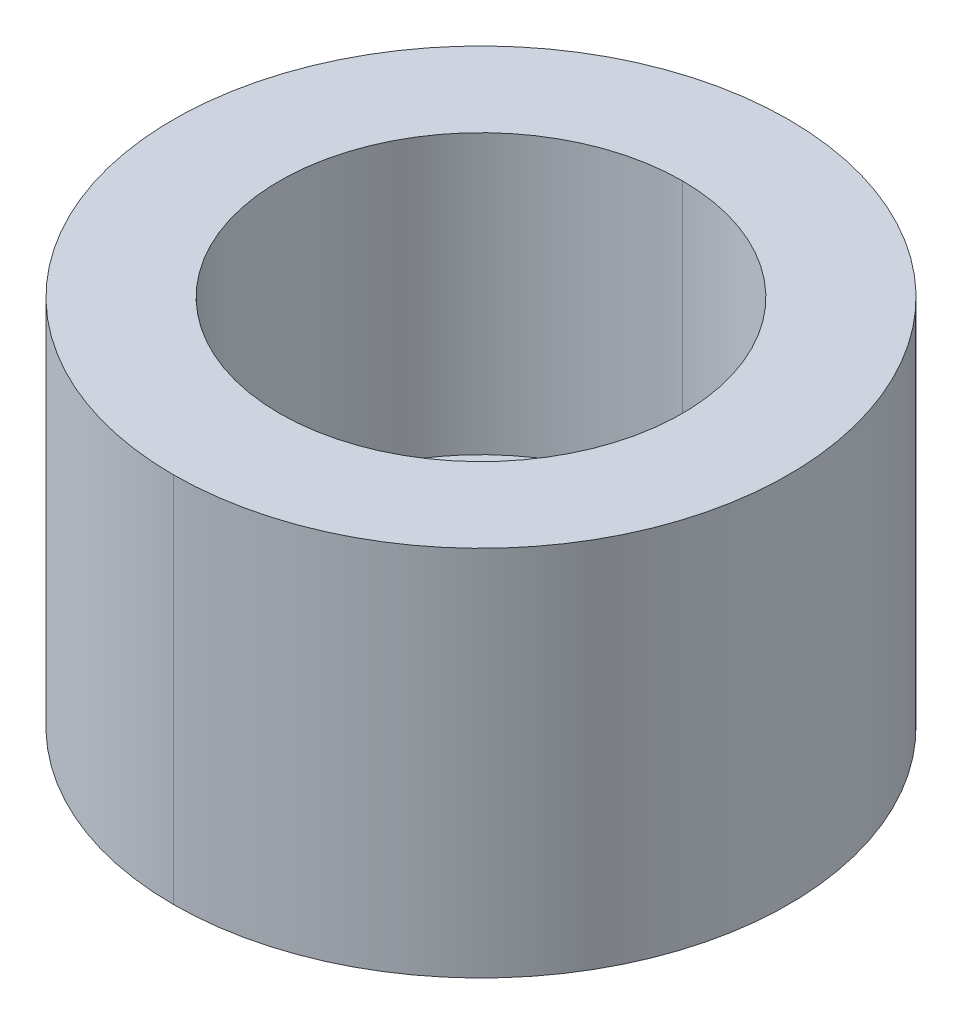
ISO-10303-21;
HEADER;
FILE_DESCRIPTION(('STEP AP214'),'2;1');
FILE_NAME('part.step','',(''),(''),'','','');
FILE_SCHEMA(('AUTOMOTIVE_DESIGN { 1 0 10303 214 1 1 1 1 }'));
ENDSEC;
DATA;
#1=APPLICATION_CONTEXT('core data for automotive mechanical design processes');
#2=APPLICATION_PROTOCOL_DEFINITION('international standard','automotive_design',2000,#1);
#3=PRODUCT_CONTEXT('',#1,'mechanical');
#4=PRODUCT('Part','Part','',(#3));
#5=PRODUCT_RELATED_PRODUCT_CATEGORY('part','',(#4));
#6=PRODUCT_DEFINITION_FORMATION('','',#4);
#7=PRODUCT_DEFINITION_CONTEXT('part definition',#1,'design');
#8=PRODUCT_DEFINITION('design','',#6,#7);
#9=PRODUCT_DEFINITION_SHAPE('','',#8);
#10=(LENGTH_UNIT() NAMED_UNIT(*) SI_UNIT(.MILLI.,.METRE.));
#11=(NAMED_UNIT(*) PLANE_ANGLE_UNIT() SI_UNIT($,.RADIAN.));
#12=(NAMED_UNIT(*) SI_UNIT($,.STERADIAN.) SOLID_ANGLE_UNIT());
#13=UNCERTAINTY_MEASURE_WITH_UNIT(LENGTH_MEASURE(1.E-05),#10,'distance_accuracy_value','');
#14=(GEOMETRIC_REPRESENTATION_CONTEXT(3) GLOBAL_UNCERTAINTY_ASSIGNED_CONTEXT((#13)) GLOBAL_UNIT_ASSIGNED_CONTEXT((#10,
#11,#12)) REPRESENTATION_CONTEXT('',''));
#15=CARTESIAN_POINT('',(0.,0.,0.));
#16=DIRECTION('',(0.,0.,1.));
#17=DIRECTION('',(1.,0.,0.));
#18=AXIS2_PLACEMENT_3D('',#15,#16,#17);
#19=CARTESIAN_POINT('',(0.,2.3876,0.));
#20=DIRECTION('',(0.,1.,0.));
#21=DIRECTION('',(0.,0.,1.));
#22=AXIS2_PLACEMENT_3D('',#19,#20,#21);
#23=PLANE('',#22);
#24=CARTESIAN_POINT('',(0.,2.3876,0.));
#25=DIRECTION('',(0.,-1.,0.));
#26=DIRECTION('',(0.,0.,-1.));
#27=AXIS2_PLACEMENT_3D('',#24,#25,#26);
#28=CIRCLE('',#27,3.5687);
#29=CARTESIAN_POINT('',(0.,2.3876,3.5687));
#30=VERTEX_POINT('',#29);
#31=CARTESIAN_POINT('',(0.,2.3876,-3.5687));
#32=VERTEX_POINT('',#31);
#33=EDGE_CURVE('E82',#30,#32,#28,.T.);
#34=ORIENTED_EDGE('',*,*,#33,.T.);
#35=CARTESIAN_POINT('',(0.,2.3876,0.));
#36=DIRECTION('',(0.,-1.,0.));
#37=DIRECTION('',(0.,0.,-1.));
#38=AXIS2_PLACEMENT_3D('',#35,#36,#37);
#39=CIRCLE('',#38,3.5687);
#40=EDGE_CURVE('E78',#32,#30,#39,.T.);
#41=ORIENTED_EDGE('',*,*,#40,.T.);
#42=EDGE_LOOP('',(#34,#41));
#43=FACE_BOUND('',#42,.T.);
#44=CARTESIAN_POINT('',(0.,2.3876,0.));
#45=DIRECTION('',(0.,1.,0.));
#46=DIRECTION('',(0.,0.,1.));
#47=AXIS2_PLACEMENT_3D('',#44,#45,#46);
#48=CIRCLE('',#47,5.1562);
#49=CARTESIAN_POINT('',(0.,2.3876,5.1562));
#50=VERTEX_POINT('',#49);
#51=CARTESIAN_POINT('',(0.,2.3876,-5.1562));
#52=VERTEX_POINT('',#51);
#53=EDGE_CURVE('E62',#50,#52,#48,.T.);
#54=ORIENTED_EDGE('',*,*,#53,.T.);
#55=CARTESIAN_POINT('',(0.,2.3876,0.));
#56=DIRECTION('',(0.,1.,0.));
#57=DIRECTION('',(0.,0.,1.));
#58=AXIS2_PLACEMENT_3D('',#55,#56,#57);
#59=CIRCLE('',#58,5.1562);
#60=EDGE_CURVE('E18',#52,#50,#59,.T.);
#61=ORIENTED_EDGE('',*,*,#60,.T.);
#62=EDGE_LOOP('',(#54,#61));
#63=FACE_BOUND('',#62,.T.);
#64=ADVANCED_FACE('F15',(#43,#63),#23,.T.);
#65=CARTESIAN_POINT('',(0.,9.525,0.));
#66=DIRECTION('',(0.,1.,0.));
#67=DIRECTION('',(0.,0.,1.));
#68=AXIS2_PLACEMENT_3D('',#65,#66,#67);
#69=CYLINDRICAL_SURFACE('',#68,5.1562);
#70=ORIENTED_EDGE('',*,*,#60,.F.);
#71=DIRECTION('',(0.,1.,0.));
#72=VECTOR('',#71,1.);
#73=CARTESIAN_POINT('',(0.,9.525,-5.1562));
#74=LINE('',#73,#72);
#75=CARTESIAN_POINT('',(0.,9.525,-5.1562));
#76=VERTEX_POINT('',#75);
#77=EDGE_CURVE('E77',#52,#76,#74,.T.);
#78=ORIENTED_EDGE('',*,*,#77,.T.);
#79=CARTESIAN_POINT('',(0.,9.525,0.));
#80=DIRECTION('',(0.,1.,0.));
#81=DIRECTION('',(0.,0.,1.));
#82=AXIS2_PLACEMENT_3D('',#79,#80,#81);
#83=CIRCLE('',#82,5.1562);
#84=CARTESIAN_POINT('',(0.,9.525,5.1562));
#85=VERTEX_POINT('',#84);
#86=EDGE_CURVE('E71',#76,#85,#83,.T.);
#87=ORIENTED_EDGE('',*,*,#86,.T.);
#88=DIRECTION('',(0.,1.,0.));
#89=VECTOR('',#88,1.);
#90=CARTESIAN_POINT('',(0.,9.525,5.1562));
#91=LINE('',#90,#89);
#92=EDGE_CURVE('E67',#85,#50,#91,.F.);
#93=ORIENTED_EDGE('',*,*,#92,.T.);
#94=EDGE_LOOP('',(#70,#78,#87,#93));
#95=FACE_BOUND('',#94,.T.);
#96=ADVANCED_FACE('F69',(#95),#69,.F.);
#97=CARTESIAN_POINT('',(0.,9.525,0.));
#98=DIRECTION('',(0.,1.,0.));
#99=DIRECTION('',(0.,0.,1.));
#100=AXIS2_PLACEMENT_3D('',#97,#98,#99);
#101=CYLINDRICAL_SURFACE('',#100,5.1562);
#102=ORIENTED_EDGE('',*,*,#53,.F.);
#103=ORIENTED_EDGE('',*,*,#92,.F.);
#104=CARTESIAN_POINT('',(0.,9.525,0.));
#105=DIRECTION('',(0.,1.,0.));
#106=DIRECTION('',(0.,0.,1.));
#107=AXIS2_PLACEMENT_3D('',#104,#105,#106);
#108=CIRCLE('',#107,5.1562);
#109=EDGE_CURVE('E86',#85,#76,#108,.T.);
#110=ORIENTED_EDGE('',*,*,#109,.T.);
#111=ORIENTED_EDGE('',*,*,#77,.F.);
#112=EDGE_LOOP('',(#102,#103,#110,#111));
#113=FACE_BOUND('',#112,.T.);
#114=ADVANCED_FACE('F76',(#113),#101,.F.);
#115=CARTESIAN_POINT('',(0.,10.00125,0.));
#116=DIRECTION('',(0.,-1.,0.));
#117=DIRECTION('',(0.,0.,-1.));
#118=AXIS2_PLACEMENT_3D('',#115,#116,#117);
#119=CYLINDRICAL_SURFACE('',#118,3.5687);
#120=CARTESIAN_POINT('',(0.,0.,0.));
#121=DIRECTION('',(0.,-1.,0.));
#122=DIRECTION('',(0.,0.,-1.));
#123=AXIS2_PLACEMENT_3D('',#120,#121,#122);
#124=CIRCLE('',#123,3.5687);
#125=CARTESIAN_POINT('',(0.,0.,3.5687));
#126=VERTEX_POINT('',#125);
#127=CARTESIAN_POINT('',(0.,0.,-3.5687));
#128=VERTEX_POINT('',#127);
#129=EDGE_CURVE('E89',#126,#128,#124,.F.);
#130=ORIENTED_EDGE('',*,*,#129,.F.);
#131=DIRECTION('',(0.,-1.,0.));
#132=VECTOR('',#131,1.);
#133=CARTESIAN_POINT('',(0.,10.00125,3.5687));
#134=LINE('',#133,#132);
#135=EDGE_CURVE('E87',#126,#30,#134,.F.);
#136=ORIENTED_EDGE('',*,*,#135,.T.);
#137=ORIENTED_EDGE('',*,*,#40,.F.);
#138=DIRECTION('',(0.,-1.,0.));
#139=VECTOR('',#138,1.);
#140=CARTESIAN_POINT('',(0.,10.00125,-3.5687));
#141=LINE('',#140,#139);
#142=EDGE_CURVE('E84',#32,#128,#141,.T.);
#143=ORIENTED_EDGE('',*,*,#142,.T.);
#144=EDGE_LOOP('',(#130,#136,#137,#143));
#145=FACE_BOUND('',#144,.T.);
#146=ADVANCED_FACE('F130',(#145),#119,.F.);
#147=CARTESIAN_POINT('',(0.,10.00125,0.));
#148=DIRECTION('',(0.,-1.,0.));
#149=DIRECTION('',(0.,0.,-1.));
#150=AXIS2_PLACEMENT_3D('',#147,#148,#149);
#151=CYLINDRICAL_SURFACE('',#150,3.5687);
#152=CARTESIAN_POINT('',(0.,0.,0.));
#153=DIRECTION('',(0.,-1.,0.));
#154=DIRECTION('',(0.,0.,-1.));
#155=AXIS2_PLACEMENT_3D('',#152,#153,#154);
#156=CIRCLE('',#155,3.5687);
#157=EDGE_CURVE('E92',#128,#126,#156,.F.);
#158=ORIENTED_EDGE('',*,*,#157,.F.);
#159=ORIENTED_EDGE('',*,*,#142,.F.);
#160=ORIENTED_EDGE('',*,*,#33,.F.);
#161=ORIENTED_EDGE('',*,*,#135,.F.);
#162=EDGE_LOOP('',(#158,#159,#160,#161));
#163=FACE_BOUND('',#162,.T.);
#164=ADVANCED_FACE('F120',(#163),#151,.F.);
#165=CARTESIAN_POINT('',(0.,9.525,0.));
#166=DIRECTION('',(0.,-1.,0.));
#167=DIRECTION('',(0.,0.,-1.));
#168=AXIS2_PLACEMENT_3D('',#165,#166,#167);
#169=PLANE('',#168);
#170=ORIENTED_EDGE('',*,*,#86,.F.);
#171=ORIENTED_EDGE('',*,*,#109,.F.);
#172=EDGE_LOOP('',(#170,#171));
#173=FACE_BOUND('',#172,.T.);
#174=CARTESIAN_POINT('',(0.,9.525,0.));
#175=DIRECTION('',(0.,-1.,0.));
#176=DIRECTION('',(0.,0.,-1.));
#177=AXIS2_PLACEMENT_3D('',#174,#175,#176);
#178=CIRCLE('',#177,7.874);
#179=CARTESIAN_POINT('',(0.,9.525,7.874));
#180=VERTEX_POINT('',#179);
#181=CARTESIAN_POINT('',(0.,9.525,-7.874));
#182=VERTEX_POINT('',#181);
#183=EDGE_CURVE('E96',#180,#182,#178,.T.);
#184=ORIENTED_EDGE('',*,*,#183,.F.);
#185=CARTESIAN_POINT('',(0.,9.525,0.));
#186=DIRECTION('',(0.,-1.,0.));
#187=DIRECTION('',(0.,0.,-1.));
#188=AXIS2_PLACEMENT_3D('',#185,#186,#187);
#189=CIRCLE('',#188,7.874);
#190=EDGE_CURVE('E99',#182,#180,#189,.T.);
#191=ORIENTED_EDGE('',*,*,#190,.F.);
#192=EDGE_LOOP('',(#184,#191));
#193=FACE_BOUND('',#192,.T.);
#194=ADVANCED_FACE('F117',(#173,#193),#169,.F.);
#195=CARTESIAN_POINT('',(0.,0.,0.));
#196=DIRECTION('',(0.,-1.,0.));
#197=DIRECTION('',(0.,0.,-1.));
#198=AXIS2_PLACEMENT_3D('',#195,#196,#197);
#199=PLANE('',#198);
#200=ORIENTED_EDGE('',*,*,#129,.T.);
#201=ORIENTED_EDGE('',*,*,#157,.T.);
#202=EDGE_LOOP('',(#200,#201));
#203=FACE_BOUND('',#202,.T.);
#204=CARTESIAN_POINT('',(0.,0.,0.));
#205=DIRECTION('',(0.,-1.,0.));
#206=DIRECTION('',(0.,0.,-1.));
#207=AXIS2_PLACEMENT_3D('',#204,#205,#206);
#208=CIRCLE('',#207,7.874);
#209=CARTESIAN_POINT('',(0.,0.,-7.874));
#210=VERTEX_POINT('',#209);
#211=CARTESIAN_POINT('',(0.,0.,7.874));
#212=VERTEX_POINT('',#211);
#213=EDGE_CURVE('E32',#210,#212,#208,.F.);
#214=ORIENTED_EDGE('',*,*,#213,.F.);
#215=CARTESIAN_POINT('',(0.,0.,0.));
#216=DIRECTION('',(0.,-1.,0.));
#217=DIRECTION('',(0.,0.,-1.));
#218=AXIS2_PLACEMENT_3D('',#215,#216,#217);
#219=CIRCLE('',#218,7.874);
#220=EDGE_CURVE('E24',#212,#210,#219,.F.);
#221=ORIENTED_EDGE('',*,*,#220,.F.);
#222=EDGE_LOOP('',(#214,#221));
#223=FACE_BOUND('',#222,.T.);
#224=ADVANCED_FACE('F119',(#203,#223),#199,.T.);
#225=CARTESIAN_POINT('',(0.,10.00125,0.));
#226=DIRECTION('',(0.,-1.,0.));
#227=DIRECTION('',(0.,0.,-1.));
#228=AXIS2_PLACEMENT_3D('',#225,#226,#227);
#229=CYLINDRICAL_SURFACE('',#228,7.874);
#230=ORIENTED_EDGE('',*,*,#183,.T.);
#231=DIRECTION('',(0.,-1.,0.));
#232=VECTOR('',#231,1.);
#233=CARTESIAN_POINT('',(0.,10.00125,-7.874));
#234=LINE('',#233,#232);
#235=EDGE_CURVE('E10',#210,#182,#234,.F.);
#236=ORIENTED_EDGE('',*,*,#235,.F.);
#237=ORIENTED_EDGE('',*,*,#213,.T.);
#238=DIRECTION('',(0.,-1.,0.));
#239=VECTOR('',#238,1.);
#240=CARTESIAN_POINT('',(0.,10.00125,7.874));
#241=LINE('',#240,#239);
#242=EDGE_CURVE('E102',#180,#212,#241,.T.);
#243=ORIENTED_EDGE('',*,*,#242,.F.);
#244=EDGE_LOOP('',(#230,#236,#237,#243));
#245=FACE_BOUND('',#244,.T.);
#246=ADVANCED_FACE('F114',(#245),#229,.T.);
#247=CARTESIAN_POINT('',(0.,10.00125,0.));
#248=DIRECTION('',(0.,-1.,0.));
#249=DIRECTION('',(0.,0.,-1.));
#250=AXIS2_PLACEMENT_3D('',#247,#248,#249);
#251=CYLINDRICAL_SURFACE('',#250,7.874);
#252=ORIENTED_EDGE('',*,*,#220,.T.);
#253=ORIENTED_EDGE('',*,*,#235,.T.);
#254=ORIENTED_EDGE('',*,*,#190,.T.);
#255=ORIENTED_EDGE('',*,*,#242,.T.);
#256=EDGE_LOOP('',(#252,#253,#254,#255));
#257=FACE_BOUND('',#256,.T.);
#258=ADVANCED_FACE('F111',(#257),#251,.T.);
#259=CLOSED_SHELL('',(#64,#96,#114,#146,#164,#194,#224,#246,#258));
#260=MANIFOLD_SOLID_BREP('B1',#259);
#261=ADVANCED_BREP_SHAPE_REPRESENTATION('',(#18,#260),#14);
#262=SHAPE_DEFINITION_REPRESENTATION(#9,#261);
ENDSEC;
END-ISO-10303-21;
